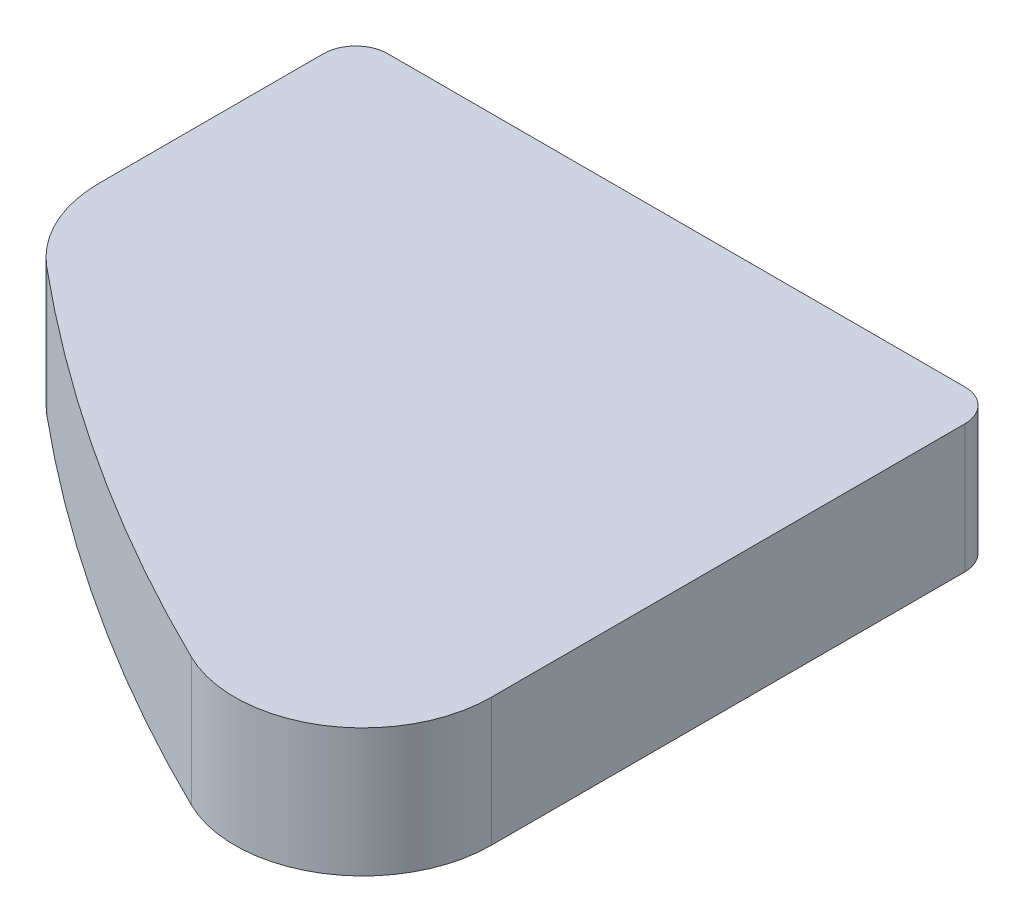
ISO-10303-21;
HEADER;
FILE_DESCRIPTION(('STEP AP214'),'2;1');
FILE_NAME('part.step','',(''),(''),'','','');
FILE_SCHEMA(('AUTOMOTIVE_DESIGN { 1 0 10303 214 1 1 1 1 }'));
ENDSEC;
DATA;
#1=APPLICATION_CONTEXT('core data for automotive mechanical design processes');
#2=APPLICATION_PROTOCOL_DEFINITION('international standard','automotive_design',2000,#1);
#3=PRODUCT_CONTEXT('',#1,'mechanical');
#4=PRODUCT('Part','Part','',(#3));
#5=PRODUCT_RELATED_PRODUCT_CATEGORY('part','',(#4));
#6=PRODUCT_DEFINITION_FORMATION('','',#4);
#7=PRODUCT_DEFINITION_CONTEXT('part definition',#1,'design');
#8=PRODUCT_DEFINITION('design','',#6,#7);
#9=PRODUCT_DEFINITION_SHAPE('','',#8);
#10=(LENGTH_UNIT() NAMED_UNIT(*) SI_UNIT(.MILLI.,.METRE.));
#11=(NAMED_UNIT(*) PLANE_ANGLE_UNIT() SI_UNIT($,.RADIAN.));
#12=(NAMED_UNIT(*) SI_UNIT($,.STERADIAN.) SOLID_ANGLE_UNIT());
#13=UNCERTAINTY_MEASURE_WITH_UNIT(LENGTH_MEASURE(1.E-05),#10,'distance_accuracy_value','');
#14=(GEOMETRIC_REPRESENTATION_CONTEXT(3) GLOBAL_UNCERTAINTY_ASSIGNED_CONTEXT((#13)) GLOBAL_UNIT_ASSIGNED_CONTEXT((#10,
#11,#12)) REPRESENTATION_CONTEXT('',''));
#15=CARTESIAN_POINT('',(0.,0.,0.));
#16=DIRECTION('',(0.,0.,1.));
#17=DIRECTION('',(1.,0.,0.));
#18=AXIS2_PLACEMENT_3D('',#15,#16,#17);
#19=CARTESIAN_POINT('',(-5.,1.,0.));
#20=DIRECTION('',(0.,1.,0.));
#21=DIRECTION('',(0.,0.,1.));
#22=AXIS2_PLACEMENT_3D('',#19,#20,#21);
#23=PLANE('',#22);
#24=DIRECTION('',(-1.,0.,0.));
#25=VECTOR('',#24,1.);
#26=CARTESIAN_POINT('',(-5.,1.,39.5857624072037));
#27=LINE('',#26,#25);
#28=CARTESIAN_POINT('',(4.50000000000001,1.,39.5857624072037));
#29=VERTEX_POINT('',#28);
#30=CARTESIAN_POINT('',(-4.50000000000001,1.,39.5857624072037));
#31=VERTEX_POINT('',#30);
#32=EDGE_CURVE('E178',#29,#31,#27,.T.);
#33=ORIENTED_EDGE('',*,*,#32,.T.);
#34=CARTESIAN_POINT('',(-4.50000000000001,1.,40.0857624072037));
#35=DIRECTION('',(0.,1.,0.));
#36=DIRECTION('',(0.,0.,1.));
#37=AXIS2_PLACEMENT_3D('',#34,#35,#36);
#38=CIRCLE('',#37,0.5);
#39=CARTESIAN_POINT('',(-5.,1.,40.0857624072037));
#40=VERTEX_POINT('',#39);
#41=EDGE_CURVE('E51',#31,#40,#38,.T.);
#42=ORIENTED_EDGE('',*,*,#41,.T.);
#43=DIRECTION('',(0.,0.,1.));
#44=VECTOR('',#43,1.);
#45=CARTESIAN_POINT('',(-5.,1.,0.));
#46=LINE('',#45,#44);
#47=CARTESIAN_POINT('',(-5.00000000000001,1.,43.5857624072037));
#48=VERTEX_POINT('',#47);
#49=EDGE_CURVE('E149',#40,#48,#46,.T.);
#50=ORIENTED_EDGE('',*,*,#49,.T.);
#51=CARTESIAN_POINT('',(-3.00000000000001,1.,43.5857624072037));
#52=DIRECTION('',(0.,1.,0.));
#53=DIRECTION('',(0.,0.,1.));
#54=AXIS2_PLACEMENT_3D('',#51,#52,#53);
#55=CIRCLE('',#54,2.);
#56=CARTESIAN_POINT('',(-4.27921540127676,1.,45.123165398334));
#57=VERTEX_POINT('',#56);
#58=EDGE_CURVE('E127',#57,#48,#55,.F.);
#59=ORIENTED_EDGE('',*,*,#58,.F.);
#60=CARTESIAN_POINT('',(16.1882310191513,1.,20.5247175402494));
#61=DIRECTION('',(0.,1.,0.));
#62=DIRECTION('',(0.,0.,1.));
#63=AXIS2_PLACEMENT_3D('',#60,#61,#62);
#64=CIRCLE('',#63,32.);
#65=CARTESIAN_POINT('',(2.12078459872326,1.,49.2667938606614));
#66=VERTEX_POINT('',#65);
#67=EDGE_CURVE('E123',#57,#66,#64,.T.);
#68=ORIENTED_EDGE('',*,*,#67,.T.);
#69=CARTESIAN_POINT('',(3.00000000000001,1.,47.4704140906356));
#70=DIRECTION('',(0.,1.,0.));
#71=DIRECTION('',(0.,0.,1.));
#72=AXIS2_PLACEMENT_3D('',#69,#70,#71);
#73=CIRCLE('',#72,2.);
#74=CARTESIAN_POINT('',(5.00000000000001,1.,47.4704140906356));
#75=VERTEX_POINT('',#74);
#76=EDGE_CURVE('E110',#75,#66,#73,.F.);
#77=ORIENTED_EDGE('',*,*,#76,.F.);
#78=DIRECTION('',(0.,0.,-1.));
#79=VECTOR('',#78,1.);
#80=CARTESIAN_POINT('',(5.,1.,-24.4948974278318));
#81=LINE('',#80,#79);
#82=CARTESIAN_POINT('',(5.00000000000001,1.,40.0857624072037));
#83=VERTEX_POINT('',#82);
#84=EDGE_CURVE('E154',#75,#83,#81,.T.);
#85=ORIENTED_EDGE('',*,*,#84,.T.);
#86=CARTESIAN_POINT('',(4.50000000000001,1.,40.0857624072037));
#87=DIRECTION('',(0.,1.,0.));
#88=DIRECTION('',(0.,0.,1.));
#89=AXIS2_PLACEMENT_3D('',#86,#87,#88);
#90=CIRCLE('',#89,0.5);
#91=EDGE_CURVE('E58',#83,#29,#90,.T.);
#92=ORIENTED_EDGE('',*,*,#91,.T.);
#93=EDGE_LOOP('',(#33,#42,#50,#59,#68,#77,#85,#92));
#94=FACE_BOUND('',#93,.T.);
#95=ADVANCED_FACE('F42',(#94),#23,.T.);
#96=CARTESIAN_POINT('',(-5.,-1.,0.));
#97=DIRECTION('',(0.,-1.,0.));
#98=DIRECTION('',(0.,0.,-1.));
#99=AXIS2_PLACEMENT_3D('',#96,#97,#98);
#100=PLANE('',#99);
#101=DIRECTION('',(0.,0.,-1.));
#102=VECTOR('',#101,1.);
#103=CARTESIAN_POINT('',(-5.00000000000001,-1.,44.5051025721682));
#104=LINE('',#103,#102);
#105=CARTESIAN_POINT('',(-5.00000000000001,-1.,43.5857624072037));
#106=VERTEX_POINT('',#105);
#107=CARTESIAN_POINT('',(-5.00000000000001,-1.,40.0857624072037));
#108=VERTEX_POINT('',#107);
#109=EDGE_CURVE('E153',#106,#108,#104,.T.);
#110=ORIENTED_EDGE('',*,*,#109,.T.);
#111=CARTESIAN_POINT('',(-4.50000000000001,-1.,40.0857624072037));
#112=DIRECTION('',(0.,-1.,0.));
#113=DIRECTION('',(0.,0.,-1.));
#114=AXIS2_PLACEMENT_3D('',#111,#112,#113);
#115=CIRCLE('',#114,0.5);
#116=CARTESIAN_POINT('',(-4.50000000000001,-1.,39.5857624072037));
#117=VERTEX_POINT('',#116);
#118=EDGE_CURVE('E166',#108,#117,#115,.T.);
#119=ORIENTED_EDGE('',*,*,#118,.T.);
#120=DIRECTION('',(1.,0.,0.));
#121=VECTOR('',#120,1.);
#122=CARTESIAN_POINT('',(-5.,-1.,39.5857624072037));
#123=LINE('',#122,#121);
#124=CARTESIAN_POINT('',(4.50000000000001,-1.,39.5857624072037));
#125=VERTEX_POINT('',#124);
#126=EDGE_CURVE('E190',#117,#125,#123,.T.);
#127=ORIENTED_EDGE('',*,*,#126,.T.);
#128=CARTESIAN_POINT('',(4.50000000000001,-1.,40.0857624072037));
#129=DIRECTION('',(0.,-1.,0.));
#130=DIRECTION('',(0.,0.,-1.));
#131=AXIS2_PLACEMENT_3D('',#128,#129,#130);
#132=CIRCLE('',#131,0.5);
#133=CARTESIAN_POINT('',(5.00000000000001,-1.,40.0857624072037));
#134=VERTEX_POINT('',#133);
#135=EDGE_CURVE('E163',#125,#134,#132,.T.);
#136=ORIENTED_EDGE('',*,*,#135,.T.);
#137=DIRECTION('',(0.,0.,1.));
#138=VECTOR('',#137,1.);
#139=CARTESIAN_POINT('',(5.,-1.,-24.4948974278318));
#140=LINE('',#139,#138);
#141=CARTESIAN_POINT('',(5.00000000000001,-1.,47.4704140906356));
#142=VERTEX_POINT('',#141);
#143=EDGE_CURVE('E152',#134,#142,#140,.T.);
#144=ORIENTED_EDGE('',*,*,#143,.T.);
#145=CARTESIAN_POINT('',(3.00000000000001,-1.,47.4704140906356));
#146=DIRECTION('',(0.,-1.,0.));
#147=DIRECTION('',(0.,0.,-1.));
#148=AXIS2_PLACEMENT_3D('',#145,#146,#147);
#149=CIRCLE('',#148,2.);
#150=CARTESIAN_POINT('',(2.12078459872326,-1.,49.2667938606614));
#151=VERTEX_POINT('',#150);
#152=EDGE_CURVE('E122',#151,#142,#149,.F.);
#153=ORIENTED_EDGE('',*,*,#152,.F.);
#154=CARTESIAN_POINT('',(16.1882310191513,-1.,20.5247175402494));
#155=DIRECTION('',(0.,-1.,0.));
#156=DIRECTION('',(0.,0.,-1.));
#157=AXIS2_PLACEMENT_3D('',#154,#155,#156);
#158=CIRCLE('',#157,32.);
#159=CARTESIAN_POINT('',(-4.27921540127676,-1.,45.123165398334));
#160=VERTEX_POINT('',#159);
#161=EDGE_CURVE('E132',#151,#160,#158,.T.);
#162=ORIENTED_EDGE('',*,*,#161,.T.);
#163=CARTESIAN_POINT('',(-3.00000000000001,-1.,43.5857624072037));
#164=DIRECTION('',(0.,-1.,0.));
#165=DIRECTION('',(0.,0.,-1.));
#166=AXIS2_PLACEMENT_3D('',#163,#164,#165);
#167=CIRCLE('',#166,2.);
#168=EDGE_CURVE('E145',#106,#160,#167,.F.);
#169=ORIENTED_EDGE('',*,*,#168,.F.);
#170=EDGE_LOOP('',(#110,#119,#127,#136,#144,#153,#162,#169));
#171=FACE_BOUND('',#170,.T.);
#172=ADVANCED_FACE('F189',(#171),#100,.T.);
#173=CARTESIAN_POINT('',(0.,0.,39.5857624072037));
#174=DIRECTION('',(0.,0.,1.));
#175=DIRECTION('',(1.,0.,0.));
#176=AXIS2_PLACEMENT_3D('',#173,#174,#175);
#177=PLANE('',#176);
#178=ORIENTED_EDGE('',*,*,#126,.F.);
#179=DIRECTION('',(0.,-1.,0.));
#180=VECTOR('',#179,1.);
#181=CARTESIAN_POINT('',(-4.50000000000001,0.,39.5857624072037));
#182=LINE('',#181,#180);
#183=EDGE_CURVE('E65',#117,#31,#182,.F.);
#184=ORIENTED_EDGE('',*,*,#183,.T.);
#185=ORIENTED_EDGE('',*,*,#32,.F.);
#186=DIRECTION('',(0.,1.,0.));
#187=VECTOR('',#186,1.);
#188=CARTESIAN_POINT('',(4.50000000000001,0.,39.5857624072037));
#189=LINE('',#188,#187);
#190=EDGE_CURVE('E169',#29,#125,#189,.F.);
#191=ORIENTED_EDGE('',*,*,#190,.T.);
#192=EDGE_LOOP('',(#178,#184,#185,#191));
#193=FACE_BOUND('',#192,.T.);
#194=ADVANCED_FACE('F192',(#193),#177,.F.);
#195=CARTESIAN_POINT('',(-5.00000000000001,2.5,44.5051025721682));
#196=DIRECTION('',(1.,0.,0.));
#197=DIRECTION('',(0.,0.,-1.));
#198=AXIS2_PLACEMENT_3D('',#195,#196,#197);
#199=PLANE('',#198);
#200=ORIENTED_EDGE('',*,*,#49,.F.);
#201=DIRECTION('',(0.,-1.,0.));
#202=VECTOR('',#201,1.);
#203=CARTESIAN_POINT('',(-5.00000000000001,2.5,40.0857624072037));
#204=LINE('',#203,#202);
#205=EDGE_CURVE('E159',#40,#108,#204,.T.);
#206=ORIENTED_EDGE('',*,*,#205,.T.);
#207=ORIENTED_EDGE('',*,*,#109,.F.);
#208=DIRECTION('',(0.,-1.,0.));
#209=VECTOR('',#208,1.);
#210=CARTESIAN_POINT('',(-5.00000000000001,2.5,43.5857624072037));
#211=LINE('',#210,#209);
#212=EDGE_CURVE('E139',#106,#48,#211,.F.);
#213=ORIENTED_EDGE('',*,*,#212,.T.);
#214=EDGE_LOOP('',(#200,#206,#207,#213));
#215=FACE_BOUND('',#214,.T.);
#216=ADVANCED_FACE('F182',(#215),#199,.F.);
#217=CARTESIAN_POINT('',(5.,2.5,-24.4948974278318));
#218=DIRECTION('',(-1.,0.,0.));
#219=DIRECTION('',(0.,0.,1.));
#220=AXIS2_PLACEMENT_3D('',#217,#218,#219);
#221=PLANE('',#220);
#222=ORIENTED_EDGE('',*,*,#143,.F.);
#223=DIRECTION('',(0.,1.,0.));
#224=VECTOR('',#223,1.);
#225=CARTESIAN_POINT('',(5.00000000000001,2.5,40.0857624072037));
#226=LINE('',#225,#224);
#227=EDGE_CURVE('E11',#134,#83,#226,.T.);
#228=ORIENTED_EDGE('',*,*,#227,.T.);
#229=ORIENTED_EDGE('',*,*,#84,.F.);
#230=DIRECTION('',(0.,-1.,0.));
#231=VECTOR('',#230,1.);
#232=CARTESIAN_POINT('',(5.00000000000001,2.5,47.4704140906356));
#233=LINE('',#232,#231);
#234=EDGE_CURVE('E117',#75,#142,#233,.T.);
#235=ORIENTED_EDGE('',*,*,#234,.T.);
#236=EDGE_LOOP('',(#222,#228,#229,#235));
#237=FACE_BOUND('',#236,.T.);
#238=ADVANCED_FACE('F203',(#237),#221,.F.);
#239=CARTESIAN_POINT('',(16.1882310191513,2.5,20.5247175402494));
#240=DIRECTION('',(0.,-1.,0.));
#241=DIRECTION('',(0.,0.,-1.));
#242=AXIS2_PLACEMENT_3D('',#239,#240,#241);
#243=CYLINDRICAL_SURFACE('',#242,32.);
#244=ORIENTED_EDGE('',*,*,#67,.F.);
#245=DIRECTION('',(0.,-1.,0.));
#246=VECTOR('',#245,1.);
#247=CARTESIAN_POINT('',(-4.27921540127676,2.5,45.123165398334));
#248=LINE('',#247,#246);
#249=EDGE_CURVE('E138',#57,#160,#248,.T.);
#250=ORIENTED_EDGE('',*,*,#249,.T.);
#251=ORIENTED_EDGE('',*,*,#161,.F.);
#252=DIRECTION('',(0.,-1.,0.));
#253=VECTOR('',#252,1.);
#254=CARTESIAN_POINT('',(2.12078459872326,2.5,49.2667938606614));
#255=LINE('',#254,#253);
#256=EDGE_CURVE('E115',#151,#66,#255,.F.);
#257=ORIENTED_EDGE('',*,*,#256,.T.);
#258=EDGE_LOOP('',(#244,#250,#251,#257));
#259=FACE_BOUND('',#258,.T.);
#260=ADVANCED_FACE('F135',(#259),#243,.T.);
#261=CARTESIAN_POINT('',(3.00000000000001,2.5,47.4704140906356));
#262=DIRECTION('',(0.,-1.,0.));
#263=DIRECTION('',(0.,0.,-1.));
#264=AXIS2_PLACEMENT_3D('',#261,#262,#263);
#265=CYLINDRICAL_SURFACE('',#264,2.);
#266=ORIENTED_EDGE('',*,*,#234,.F.);
#267=ORIENTED_EDGE('',*,*,#76,.T.);
#268=ORIENTED_EDGE('',*,*,#256,.F.);
#269=ORIENTED_EDGE('',*,*,#152,.T.);
#270=EDGE_LOOP('',(#266,#267,#268,#269));
#271=FACE_BOUND('',#270,.T.);
#272=ADVANCED_FACE('F112',(#271),#265,.T.);
#273=CARTESIAN_POINT('',(-3.00000000000001,2.5,43.5857624072037));
#274=DIRECTION('',(0.,-1.,0.));
#275=DIRECTION('',(0.,0.,-1.));
#276=AXIS2_PLACEMENT_3D('',#273,#274,#275);
#277=CYLINDRICAL_SURFACE('',#276,2.);
#278=ORIENTED_EDGE('',*,*,#249,.F.);
#279=ORIENTED_EDGE('',*,*,#58,.T.);
#280=ORIENTED_EDGE('',*,*,#212,.F.);
#281=ORIENTED_EDGE('',*,*,#168,.T.);
#282=EDGE_LOOP('',(#278,#279,#280,#281));
#283=FACE_BOUND('',#282,.T.);
#284=ADVANCED_FACE('F211',(#283),#277,.T.);
#285=CARTESIAN_POINT('',(-4.50000000000001,2.5,40.0857624072037));
#286=DIRECTION('',(0.,-1.,0.));
#287=DIRECTION('',(0.,0.,-1.));
#288=AXIS2_PLACEMENT_3D('',#285,#286,#287);
#289=CYLINDRICAL_SURFACE('',#288,0.5);
#290=ORIENTED_EDGE('',*,*,#41,.F.);
#291=ORIENTED_EDGE('',*,*,#183,.F.);
#292=ORIENTED_EDGE('',*,*,#118,.F.);
#293=ORIENTED_EDGE('',*,*,#205,.F.);
#294=EDGE_LOOP('',(#290,#291,#292,#293));
#295=FACE_BOUND('',#294,.T.);
#296=ADVANCED_FACE('F186',(#295),#289,.T.);
#297=CARTESIAN_POINT('',(4.50000000000001,2.5,40.0857624072037));
#298=DIRECTION('',(0.,1.,0.));
#299=DIRECTION('',(0.,0.,1.));
#300=AXIS2_PLACEMENT_3D('',#297,#298,#299);
#301=CYLINDRICAL_SURFACE('',#300,0.5);
#302=ORIENTED_EDGE('',*,*,#135,.F.);
#303=ORIENTED_EDGE('',*,*,#190,.F.);
#304=ORIENTED_EDGE('',*,*,#91,.F.);
#305=ORIENTED_EDGE('',*,*,#227,.F.);
#306=EDGE_LOOP('',(#302,#303,#304,#305));
#307=FACE_BOUND('',#306,.T.);
#308=ADVANCED_FACE('F44',(#307),#301,.T.);
#309=CLOSED_SHELL('',(#95,#172,#194,#216,#238,#260,#272,#284,#296,#308));
#310=MANIFOLD_SOLID_BREP('B2',#309);
#311=ADVANCED_BREP_SHAPE_REPRESENTATION('',(#18,#310),#14);
#312=SHAPE_DEFINITION_REPRESENTATION(#9,#311);
ENDSEC;
END-ISO-10303-21;
